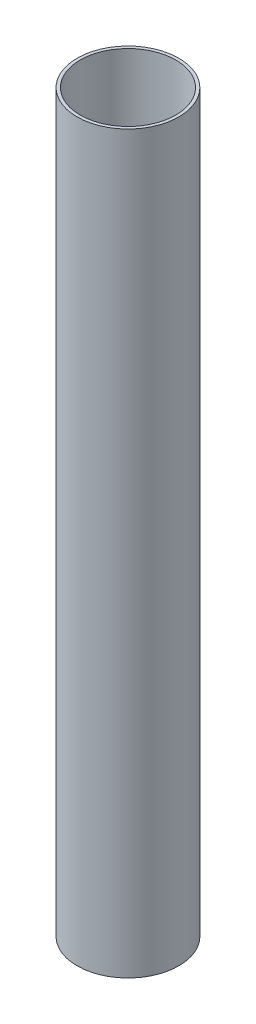
ISO-10303-21;
HEADER;
FILE_DESCRIPTION(('STEP AP214'),'2;1');
FILE_NAME('part.step','',(''),(''),'','','');
FILE_SCHEMA(('AUTOMOTIVE_DESIGN { 1 0 10303 214 1 1 1 1 }'));
ENDSEC;
DATA;
#1=APPLICATION_CONTEXT('core data for automotive mechanical design processes');
#2=APPLICATION_PROTOCOL_DEFINITION('international standard','automotive_design',2000,#1);
#3=PRODUCT_CONTEXT('',#1,'mechanical');
#4=PRODUCT('Part','Part','',(#3));
#5=PRODUCT_RELATED_PRODUCT_CATEGORY('part','',(#4));
#6=PRODUCT_DEFINITION_FORMATION('','',#4);
#7=PRODUCT_DEFINITION_CONTEXT('part definition',#1,'design');
#8=PRODUCT_DEFINITION('design','',#6,#7);
#9=PRODUCT_DEFINITION_SHAPE('','',#8);
#10=(LENGTH_UNIT() NAMED_UNIT(*) SI_UNIT(.MILLI.,.METRE.));
#11=(NAMED_UNIT(*) PLANE_ANGLE_UNIT() SI_UNIT($,.RADIAN.));
#12=(NAMED_UNIT(*) SI_UNIT($,.STERADIAN.) SOLID_ANGLE_UNIT());
#13=UNCERTAINTY_MEASURE_WITH_UNIT(LENGTH_MEASURE(1.E-05),#10,'distance_accuracy_value','');
#14=(GEOMETRIC_REPRESENTATION_CONTEXT(3) GLOBAL_UNCERTAINTY_ASSIGNED_CONTEXT((#13)) GLOBAL_UNIT_ASSIGNED_CONTEXT((#10,
#11,#12)) REPRESENTATION_CONTEXT('',''));
#15=CARTESIAN_POINT('',(0.,0.,0.));
#16=DIRECTION('',(0.,0.,1.));
#17=DIRECTION('',(1.,0.,0.));
#18=AXIS2_PLACEMENT_3D('',#15,#16,#17);
#19=CARTESIAN_POINT('',(0.,1146.81,0.));
#20=DIRECTION('',(0.,1.,0.));
#21=DIRECTION('',(0.,0.,1.));
#22=AXIS2_PLACEMENT_3D('',#19,#20,#21);
#23=CYLINDRICAL_SURFACE('',#22,49.53);
#24=CARTESIAN_POINT('',(0.,0.,0.));
#25=DIRECTION('',(0.,1.,0.));
#26=DIRECTION('',(0.,0.,1.));
#27=AXIS2_PLACEMENT_3D('',#24,#25,#26);
#28=CIRCLE('',#27,49.53);
#29=CARTESIAN_POINT('',(0.,0.,49.53));
#30=VERTEX_POINT('',#29);
#31=EDGE_CURVE('E10',#30,#30,#28,.T.);
#32=ORIENTED_EDGE('',*,*,#31,.F.);
#33=EDGE_LOOP('',(#32));
#34=FACE_BOUND('',#33,.T.);
#35=CARTESIAN_POINT('',(0.,762.,0.));
#36=DIRECTION('',(0.,1.,0.));
#37=DIRECTION('',(0.,0.,1.));
#38=AXIS2_PLACEMENT_3D('',#35,#36,#37);
#39=CIRCLE('',#38,49.5299999999999);
#40=CARTESIAN_POINT('',(0.,762.,49.5299999999999));
#41=VERTEX_POINT('',#40);
#42=EDGE_CURVE('E57',#41,#41,#39,.T.);
#43=ORIENTED_EDGE('',*,*,#42,.T.);
#44=EDGE_LOOP('',(#43));
#45=FACE_BOUND('',#44,.T.);
#46=ADVANCED_FACE('F40',(#34,#45),#23,.F.);
#47=CARTESIAN_POINT('',(49.53,0.,0.));
#48=DIRECTION('',(0.,1.,0.));
#49=DIRECTION('',(0.,0.,1.));
#50=AXIS2_PLACEMENT_3D('',#47,#48,#49);
#51=PLANE('',#50);
#52=CARTESIAN_POINT('',(0.,0.,0.));
#53=DIRECTION('',(0.,1.,0.));
#54=DIRECTION('',(0.,0.,1.));
#55=AXIS2_PLACEMENT_3D('',#52,#53,#54);
#56=CIRCLE('',#55,52.705);
#57=CARTESIAN_POINT('',(0.,0.,52.705));
#58=VERTEX_POINT('',#57);
#59=EDGE_CURVE('E47',#58,#58,#56,.T.);
#60=ORIENTED_EDGE('',*,*,#59,.F.);
#61=EDGE_LOOP('',(#60));
#62=FACE_BOUND('',#61,.T.);
#63=ORIENTED_EDGE('',*,*,#31,.T.);
#64=EDGE_LOOP('',(#63));
#65=FACE_BOUND('',#64,.T.);
#66=ADVANCED_FACE('F73',(#62,#65),#51,.F.);
#67=CARTESIAN_POINT('',(0.,1146.81,0.));
#68=DIRECTION('',(0.,1.,0.));
#69=DIRECTION('',(0.,0.,1.));
#70=AXIS2_PLACEMENT_3D('',#67,#68,#69);
#71=CYLINDRICAL_SURFACE('',#70,52.7049999999999);
#72=CARTESIAN_POINT('',(0.,762.,0.));
#73=DIRECTION('',(0.,1.,0.));
#74=DIRECTION('',(0.,0.,1.));
#75=AXIS2_PLACEMENT_3D('',#72,#73,#74);
#76=CIRCLE('',#75,52.7049999999999);
#77=CARTESIAN_POINT('',(0.,762.,52.7049999999999));
#78=VERTEX_POINT('',#77);
#79=EDGE_CURVE('E52',#78,#78,#76,.T.);
#80=ORIENTED_EDGE('',*,*,#79,.F.);
#81=EDGE_LOOP('',(#80));
#82=FACE_BOUND('',#81,.T.);
#83=ORIENTED_EDGE('',*,*,#59,.T.);
#84=EDGE_LOOP('',(#83));
#85=FACE_BOUND('',#84,.T.);
#86=ADVANCED_FACE('F68',(#82,#85),#71,.T.);
#87=CARTESIAN_POINT('',(49.5299999999999,762.,0.));
#88=DIRECTION('',(0.,-1.,0.));
#89=DIRECTION('',(0.,0.,-1.));
#90=AXIS2_PLACEMENT_3D('',#87,#88,#89);
#91=PLANE('',#90);
#92=ORIENTED_EDGE('',*,*,#42,.F.);
#93=EDGE_LOOP('',(#92));
#94=FACE_BOUND('',#93,.T.);
#95=ORIENTED_EDGE('',*,*,#79,.T.);
#96=EDGE_LOOP('',(#95));
#97=FACE_BOUND('',#96,.T.);
#98=ADVANCED_FACE('F65',(#94,#97),#91,.F.);
#99=CLOSED_SHELL('',(#46,#66,#86,#98));
#100=MANIFOLD_SOLID_BREP('B2',#99);
#101=ADVANCED_BREP_SHAPE_REPRESENTATION('',(#18,#100),#14);
#102=SHAPE_DEFINITION_REPRESENTATION(#9,#101);
ENDSEC;
END-ISO-10303-21;
